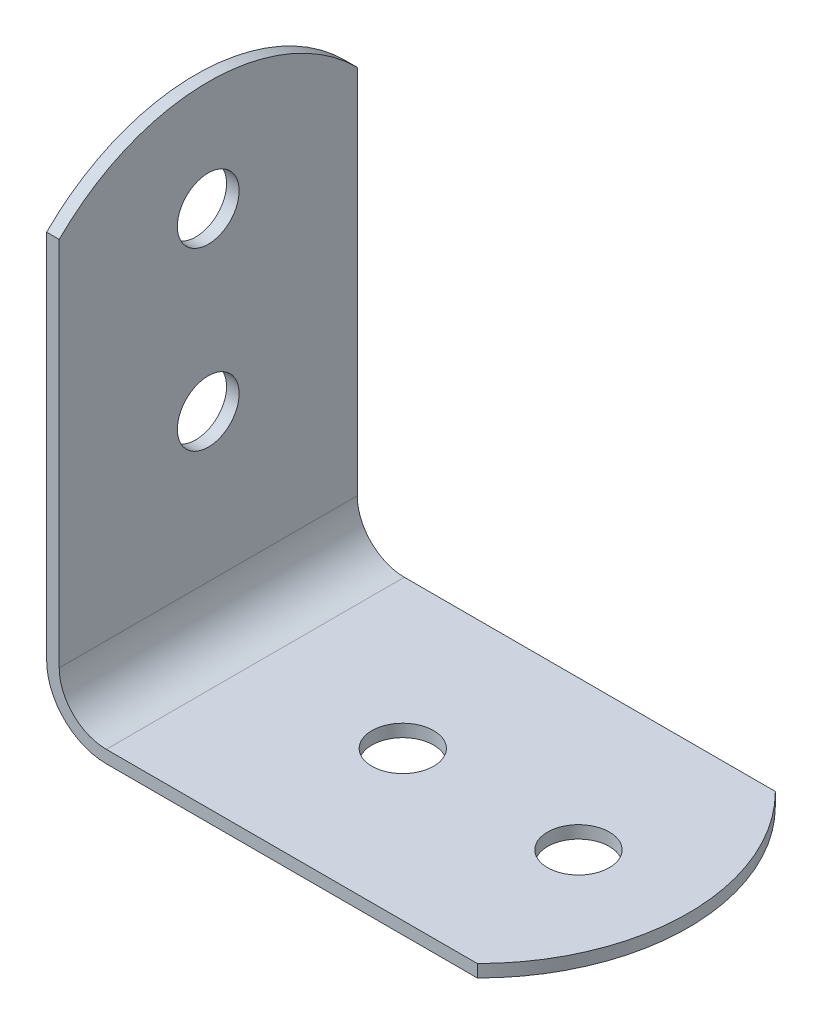
ISO-10303-21;
HEADER;
FILE_DESCRIPTION(('STEP AP214'),'2;1');
FILE_NAME('part.step','',(''),(''),'','','');
FILE_SCHEMA(('AUTOMOTIVE_DESIGN { 1 0 10303 214 1 1 1 1 }'));
ENDSEC;
DATA;
#1=APPLICATION_CONTEXT('core data for automotive mechanical design processes');
#2=APPLICATION_PROTOCOL_DEFINITION('international standard','automotive_design',2000,#1);
#3=PRODUCT_CONTEXT('',#1,'mechanical');
#4=PRODUCT('Part','Part','',(#3));
#5=PRODUCT_RELATED_PRODUCT_CATEGORY('part','',(#4));
#6=PRODUCT_DEFINITION_FORMATION('','',#4);
#7=PRODUCT_DEFINITION_CONTEXT('part definition',#1,'design');
#8=PRODUCT_DEFINITION('design','',#6,#7);
#9=PRODUCT_DEFINITION_SHAPE('','',#8);
#10=(LENGTH_UNIT() NAMED_UNIT(*) SI_UNIT(.MILLI.,.METRE.));
#11=(NAMED_UNIT(*) PLANE_ANGLE_UNIT() SI_UNIT($,.RADIAN.));
#12=(NAMED_UNIT(*) SI_UNIT($,.STERADIAN.) SOLID_ANGLE_UNIT());
#13=UNCERTAINTY_MEASURE_WITH_UNIT(LENGTH_MEASURE(1.E-05),#10,'distance_accuracy_value','');
#14=(GEOMETRIC_REPRESENTATION_CONTEXT(3) GLOBAL_UNCERTAINTY_ASSIGNED_CONTEXT((#13)) GLOBAL_UNIT_ASSIGNED_CONTEXT((#10,
#11,#12)) REPRESENTATION_CONTEXT('',''));
#15=CARTESIAN_POINT('',(0.,0.,0.));
#16=DIRECTION('',(0.,0.,1.));
#17=DIRECTION('',(1.,0.,0.));
#18=AXIS2_PLACEMENT_3D('',#15,#16,#17);
#19=CARTESIAN_POINT('',(0.,39.878,24.13));
#20=DIRECTION('',(1.,0.,0.));
#21=DIRECTION('',(0.,0.,-1.));
#22=AXIS2_PLACEMENT_3D('',#19,#20,#21);
#23=PLANE('',#22);
#24=CARTESIAN_POINT('',(0.,30.988,12.065));
#25=DIRECTION('',(-1.,0.,0.));
#26=DIRECTION('',(0.,0.,1.));
#27=AXIS2_PLACEMENT_3D('',#24,#25,#26);
#28=CIRCLE('',#27,2.5);
#29=CARTESIAN_POINT('',(0.,30.988,14.565));
#30=VERTEX_POINT('',#29);
#31=EDGE_CURVE('E201',#30,#30,#28,.T.);
#32=ORIENTED_EDGE('',*,*,#31,.F.);
#33=EDGE_LOOP('',(#32));
#34=FACE_BOUND('',#33,.T.);
#35=CARTESIAN_POINT('',(0.,16.764,12.065));
#36=DIRECTION('',(-1.,0.,0.));
#37=DIRECTION('',(0.,0.,1.));
#38=AXIS2_PLACEMENT_3D('',#35,#36,#37);
#39=CIRCLE('',#38,2.5);
#40=CARTESIAN_POINT('',(0.,16.764,14.565));
#41=VERTEX_POINT('',#40);
#42=EDGE_CURVE('E128',#41,#41,#39,.T.);
#43=ORIENTED_EDGE('',*,*,#42,.F.);
#44=EDGE_LOOP('',(#43));
#45=FACE_BOUND('',#44,.T.);
#46=DIRECTION('',(0.,-1.,0.));
#47=VECTOR('',#46,1.);
#48=CARTESIAN_POINT('',(0.,39.878,24.13));
#49=LINE('',#48,#47);
#50=CARTESIAN_POINT('',(0.,34.8620039576731,24.13));
#51=VERTEX_POINT('',#50);
#52=CARTESIAN_POINT('',(0.,4.826,24.13));
#53=VERTEX_POINT('',#52);
#54=EDGE_CURVE('E110',#51,#53,#49,.T.);
#55=ORIENTED_EDGE('',*,*,#54,.F.);
#56=CARTESIAN_POINT('',(0.,22.86,12.065));
#57=DIRECTION('',(1.,0.,0.));
#58=DIRECTION('',(0.,0.,-1.));
#59=AXIS2_PLACEMENT_3D('',#56,#57,#58);
#60=CIRCLE('',#59,17.018);
#61=CARTESIAN_POINT('',(0.,34.8620039576731,0.));
#62=VERTEX_POINT('',#61);
#63=EDGE_CURVE('E99',#62,#51,#60,.T.);
#64=ORIENTED_EDGE('',*,*,#63,.F.);
#65=DIRECTION('',(0.,-1.,0.));
#66=VECTOR('',#65,1.);
#67=CARTESIAN_POINT('',(0.,39.878,0.));
#68=LINE('',#67,#66);
#69=CARTESIAN_POINT('',(0.,4.826,0.));
#70=VERTEX_POINT('',#69);
#71=EDGE_CURVE('E134',#62,#70,#68,.T.);
#72=ORIENTED_EDGE('',*,*,#71,.T.);
#73=DIRECTION('',(0.,0.,-1.));
#74=VECTOR('',#73,1.);
#75=CARTESIAN_POINT('',(0.,4.826,24.13));
#76=LINE('',#75,#74);
#77=EDGE_CURVE('E116',#70,#53,#76,.F.);
#78=ORIENTED_EDGE('',*,*,#77,.T.);
#79=EDGE_LOOP('',(#55,#64,#72,#78));
#80=FACE_BOUND('',#79,.T.);
#81=ADVANCED_FACE('F37',(#34,#45,#80),#23,.F.);
#82=CARTESIAN_POINT('',(0.,0.,24.13));
#83=DIRECTION('',(0.,1.,0.));
#84=DIRECTION('',(0.,0.,1.));
#85=AXIS2_PLACEMENT_3D('',#82,#83,#84);
#86=PLANE('',#85);
#87=CARTESIAN_POINT('',(30.988,0.,12.065));
#88=DIRECTION('',(0.,-1.,0.));
#89=DIRECTION('',(0.,0.,-1.));
#90=AXIS2_PLACEMENT_3D('',#87,#88,#89);
#91=CIRCLE('',#90,2.49999999999999);
#92=CARTESIAN_POINT('',(30.988,0.,9.56500000000001));
#93=VERTEX_POINT('',#92);
#94=EDGE_CURVE('E184',#93,#93,#91,.T.);
#95=ORIENTED_EDGE('',*,*,#94,.F.);
#96=EDGE_LOOP('',(#95));
#97=FACE_BOUND('',#96,.T.);
#98=CARTESIAN_POINT('',(16.764,0.,12.065));
#99=DIRECTION('',(0.,-1.,0.));
#100=DIRECTION('',(0.,0.,-1.));
#101=AXIS2_PLACEMENT_3D('',#98,#99,#100);
#102=CIRCLE('',#101,2.49999999999999);
#103=CARTESIAN_POINT('',(16.764,0.,9.56500000000001));
#104=VERTEX_POINT('',#103);
#105=EDGE_CURVE('E195',#104,#104,#102,.T.);
#106=ORIENTED_EDGE('',*,*,#105,.F.);
#107=EDGE_LOOP('',(#106));
#108=FACE_BOUND('',#107,.T.);
#109=DIRECTION('',(1.,0.,0.));
#110=VECTOR('',#109,1.);
#111=CARTESIAN_POINT('',(0.,0.,0.));
#112=LINE('',#111,#110);
#113=CARTESIAN_POINT('',(4.826,0.,0.));
#114=VERTEX_POINT('',#113);
#115=CARTESIAN_POINT('',(34.8620039576731,0.,0.));
#116=VERTEX_POINT('',#115);
#117=EDGE_CURVE('E136',#114,#116,#112,.T.);
#118=ORIENTED_EDGE('',*,*,#117,.T.);
#119=CARTESIAN_POINT('',(22.86,0.,12.065));
#120=DIRECTION('',(0.,1.,0.));
#121=DIRECTION('',(0.,0.,1.));
#122=AXIS2_PLACEMENT_3D('',#119,#120,#121);
#123=CIRCLE('',#122,17.018);
#124=CARTESIAN_POINT('',(34.8620039576731,0.,24.13));
#125=VERTEX_POINT('',#124);
#126=EDGE_CURVE('E59',#125,#116,#123,.T.);
#127=ORIENTED_EDGE('',*,*,#126,.F.);
#128=DIRECTION('',(1.,0.,0.));
#129=VECTOR('',#128,1.);
#130=CARTESIAN_POINT('',(0.,0.,24.13));
#131=LINE('',#130,#129);
#132=CARTESIAN_POINT('',(4.826,0.,24.13));
#133=VERTEX_POINT('',#132);
#134=EDGE_CURVE('E118',#133,#125,#131,.T.);
#135=ORIENTED_EDGE('',*,*,#134,.F.);
#136=DIRECTION('',(0.,0.,-1.));
#137=VECTOR('',#136,1.);
#138=CARTESIAN_POINT('',(4.826,0.,24.13));
#139=LINE('',#138,#137);
#140=EDGE_CURVE('E151',#133,#114,#139,.T.);
#141=ORIENTED_EDGE('',*,*,#140,.T.);
#142=EDGE_LOOP('',(#118,#127,#135,#141));
#143=FACE_BOUND('',#142,.T.);
#144=ADVANCED_FACE('F167',(#97,#108,#143),#86,.F.);
#145=CARTESIAN_POINT('',(39.878,1.016,24.13));
#146=DIRECTION('',(0.,-1.,0.));
#147=DIRECTION('',(1.,0.,0.));
#148=AXIS2_PLACEMENT_3D('',#145,#146,#147);
#149=PLANE('',#148);
#150=CARTESIAN_POINT('',(30.988,1.016,12.065));
#151=DIRECTION('',(0.,-1.,0.));
#152=DIRECTION('',(1.,0.,0.));
#153=AXIS2_PLACEMENT_3D('',#150,#151,#152);
#154=CIRCLE('',#153,2.49999999999999);
#155=CARTESIAN_POINT('',(33.488,1.016,12.065));
#156=VERTEX_POINT('',#155);
#157=EDGE_CURVE('E188',#156,#156,#154,.T.);
#158=ORIENTED_EDGE('',*,*,#157,.T.);
#159=EDGE_LOOP('',(#158));
#160=FACE_BOUND('',#159,.T.);
#161=CARTESIAN_POINT('',(16.764,1.016,12.065));
#162=DIRECTION('',(0.,-1.,0.));
#163=DIRECTION('',(1.,0.,0.));
#164=AXIS2_PLACEMENT_3D('',#161,#162,#163);
#165=CIRCLE('',#164,2.49999999999999);
#166=CARTESIAN_POINT('',(19.264,1.016,12.065));
#167=VERTEX_POINT('',#166);
#168=EDGE_CURVE('E198',#167,#167,#165,.T.);
#169=ORIENTED_EDGE('',*,*,#168,.T.);
#170=EDGE_LOOP('',(#169));
#171=FACE_BOUND('',#170,.T.);
#172=DIRECTION('',(-1.,0.,0.));
#173=VECTOR('',#172,1.);
#174=CARTESIAN_POINT('',(39.878,1.016,24.13));
#175=LINE('',#174,#173);
#176=CARTESIAN_POINT('',(34.8620039576731,1.016,24.13));
#177=VERTEX_POINT('',#176);
#178=CARTESIAN_POINT('',(4.826,1.016,24.13));
#179=VERTEX_POINT('',#178);
#180=EDGE_CURVE('E122',#177,#179,#175,.T.);
#181=ORIENTED_EDGE('',*,*,#180,.F.);
#182=CARTESIAN_POINT('',(22.86,1.016,12.065));
#183=DIRECTION('',(0.,-1.,0.));
#184=DIRECTION('',(1.,0.,0.));
#185=AXIS2_PLACEMENT_3D('',#182,#183,#184);
#186=CIRCLE('',#185,17.018);
#187=CARTESIAN_POINT('',(34.8620039576731,1.016,0.));
#188=VERTEX_POINT('',#187);
#189=EDGE_CURVE('E182',#177,#188,#186,.F.);
#190=ORIENTED_EDGE('',*,*,#189,.T.);
#191=DIRECTION('',(-1.,0.,0.));
#192=VECTOR('',#191,1.);
#193=CARTESIAN_POINT('',(39.878,1.016,0.));
#194=LINE('',#193,#192);
#195=CARTESIAN_POINT('',(4.826,1.016,0.));
#196=VERTEX_POINT('',#195);
#197=EDGE_CURVE('E125',#188,#196,#194,.T.);
#198=ORIENTED_EDGE('',*,*,#197,.T.);
#199=DIRECTION('',(0.,0.,-1.));
#200=VECTOR('',#199,1.);
#201=CARTESIAN_POINT('',(4.826,1.016,24.13));
#202=LINE('',#201,#200);
#203=EDGE_CURVE('E143',#196,#179,#202,.F.);
#204=ORIENTED_EDGE('',*,*,#203,.T.);
#205=EDGE_LOOP('',(#181,#190,#198,#204));
#206=FACE_BOUND('',#205,.T.);
#207=ADVANCED_FACE('F181',(#160,#171,#206),#149,.F.);
#208=CARTESIAN_POINT('',(1.016,1.01599999999999,24.13));
#209=DIRECTION('',(-1.,0.,0.));
#210=DIRECTION('',(0.,0.,1.));
#211=AXIS2_PLACEMENT_3D('',#208,#209,#210);
#212=PLANE('',#211);
#213=CARTESIAN_POINT('',(1.016,30.988,12.065));
#214=DIRECTION('',(-1.,0.,0.));
#215=DIRECTION('',(0.,0.,1.));
#216=AXIS2_PLACEMENT_3D('',#213,#214,#215);
#217=CIRCLE('',#216,2.49999999999999);
#218=CARTESIAN_POINT('',(1.016,30.988,14.565));
#219=VERTEX_POINT('',#218);
#220=EDGE_CURVE('E203',#219,#219,#217,.T.);
#221=ORIENTED_EDGE('',*,*,#220,.T.);
#222=EDGE_LOOP('',(#221));
#223=FACE_BOUND('',#222,.T.);
#224=CARTESIAN_POINT('',(1.016,16.764,12.065));
#225=DIRECTION('',(-1.,0.,0.));
#226=DIRECTION('',(0.,0.,1.));
#227=AXIS2_PLACEMENT_3D('',#224,#225,#226);
#228=CIRCLE('',#227,2.49999999999999);
#229=CARTESIAN_POINT('',(1.016,16.764,14.565));
#230=VERTEX_POINT('',#229);
#231=EDGE_CURVE('E137',#230,#230,#228,.T.);
#232=ORIENTED_EDGE('',*,*,#231,.T.);
#233=EDGE_LOOP('',(#232));
#234=FACE_BOUND('',#233,.T.);
#235=DIRECTION('',(0.,1.,0.));
#236=VECTOR('',#235,1.);
#237=CARTESIAN_POINT('',(1.016,1.01599999999999,0.));
#238=LINE('',#237,#236);
#239=CARTESIAN_POINT('',(1.016,4.82599999999999,0.));
#240=VERTEX_POINT('',#239);
#241=CARTESIAN_POINT('',(1.016,34.8620039576731,0.));
#242=VERTEX_POINT('',#241);
#243=EDGE_CURVE('E119',#240,#242,#238,.T.);
#244=ORIENTED_EDGE('',*,*,#243,.T.);
#245=CARTESIAN_POINT('',(1.01600000000001,22.86,12.065));
#246=DIRECTION('',(-1.,0.,0.));
#247=DIRECTION('',(0.,0.,1.));
#248=AXIS2_PLACEMENT_3D('',#245,#246,#247);
#249=CIRCLE('',#248,17.018);
#250=CARTESIAN_POINT('',(1.01600000000003,34.8620039576731,24.13));
#251=VERTEX_POINT('',#250);
#252=EDGE_CURVE('E52',#242,#251,#249,.F.);
#253=ORIENTED_EDGE('',*,*,#252,.T.);
#254=DIRECTION('',(0.,1.,0.));
#255=VECTOR('',#254,1.);
#256=CARTESIAN_POINT('',(1.016,1.01599999999999,24.13));
#257=LINE('',#256,#255);
#258=CARTESIAN_POINT('',(1.016,4.82599999999999,24.13));
#259=VERTEX_POINT('',#258);
#260=EDGE_CURVE('E113',#259,#251,#257,.T.);
#261=ORIENTED_EDGE('',*,*,#260,.F.);
#262=DIRECTION('',(0.,0.,-1.));
#263=VECTOR('',#262,1.);
#264=CARTESIAN_POINT('',(1.016,4.82599999999999,0.));
#265=LINE('',#264,#263);
#266=EDGE_CURVE('E133',#259,#240,#265,.T.);
#267=ORIENTED_EDGE('',*,*,#266,.T.);
#268=EDGE_LOOP('',(#244,#253,#261,#267));
#269=FACE_BOUND('',#268,.T.);
#270=ADVANCED_FACE('F173',(#223,#234,#269),#212,.F.);
#271=CARTESIAN_POINT('',(0.,0.,24.13));
#272=DIRECTION('',(0.,0.,1.));
#273=DIRECTION('',(1.,0.,0.));
#274=AXIS2_PLACEMENT_3D('',#271,#272,#273);
#275=PLANE('',#274);
#276=DIRECTION('',(-1.,0.,0.));
#277=VECTOR('',#276,1.);
#278=CARTESIAN_POINT('',(39.878,34.8620039576731,24.13));
#279=LINE('',#278,#277);
#280=EDGE_CURVE('E102',#251,#51,#279,.T.);
#281=ORIENTED_EDGE('',*,*,#280,.T.);
#282=ORIENTED_EDGE('',*,*,#54,.T.);
#283=CARTESIAN_POINT('',(4.826,4.826,24.13));
#284=DIRECTION('',(0.,0.,1.));
#285=DIRECTION('',(1.,0.,0.));
#286=AXIS2_PLACEMENT_3D('',#283,#284,#285);
#287=CIRCLE('',#286,4.826);
#288=EDGE_CURVE('E158',#53,#133,#287,.T.);
#289=ORIENTED_EDGE('',*,*,#288,.T.);
#290=ORIENTED_EDGE('',*,*,#134,.T.);
#291=DIRECTION('',(0.,-1.,0.));
#292=VECTOR('',#291,1.);
#293=CARTESIAN_POINT('',(34.8620039576731,39.878,24.13));
#294=LINE('',#293,#292);
#295=EDGE_CURVE('E185',#177,#125,#294,.T.);
#296=ORIENTED_EDGE('',*,*,#295,.F.);
#297=ORIENTED_EDGE('',*,*,#180,.T.);
#298=CARTESIAN_POINT('',(4.826,4.82599999999999,24.13));
#299=DIRECTION('',(0.,0.,1.));
#300=DIRECTION('',(1.,0.,0.));
#301=AXIS2_PLACEMENT_3D('',#298,#299,#300);
#302=CIRCLE('',#301,3.81);
#303=EDGE_CURVE('E149',#179,#259,#302,.F.);
#304=ORIENTED_EDGE('',*,*,#303,.T.);
#305=ORIENTED_EDGE('',*,*,#260,.T.);
#306=EDGE_LOOP('',(#281,#282,#289,#290,#296,#297,#304,#305));
#307=FACE_BOUND('',#306,.T.);
#308=ADVANCED_FACE('F109',(#307),#275,.T.);
#309=CARTESIAN_POINT('',(0.,0.,0.));
#310=DIRECTION('',(0.,0.,1.));
#311=DIRECTION('',(1.,0.,0.));
#312=AXIS2_PLACEMENT_3D('',#309,#310,#311);
#313=PLANE('',#312);
#314=ORIENTED_EDGE('',*,*,#71,.F.);
#315=DIRECTION('',(-1.,0.,0.));
#316=VECTOR('',#315,1.);
#317=CARTESIAN_POINT('',(39.878,34.8620039576731,0.));
#318=LINE('',#317,#316);
#319=EDGE_CURVE('E11',#62,#242,#318,.F.);
#320=ORIENTED_EDGE('',*,*,#319,.T.);
#321=ORIENTED_EDGE('',*,*,#243,.F.);
#322=CARTESIAN_POINT('',(4.826,4.82599999999999,0.));
#323=DIRECTION('',(0.,0.,1.));
#324=DIRECTION('',(1.,0.,0.));
#325=AXIS2_PLACEMENT_3D('',#322,#323,#324);
#326=CIRCLE('',#325,3.81);
#327=EDGE_CURVE('E146',#240,#196,#326,.T.);
#328=ORIENTED_EDGE('',*,*,#327,.T.);
#329=ORIENTED_EDGE('',*,*,#197,.F.);
#330=DIRECTION('',(0.,-1.,0.));
#331=VECTOR('',#330,1.);
#332=CARTESIAN_POINT('',(34.8620039576731,39.878,0.));
#333=LINE('',#332,#331);
#334=EDGE_CURVE('E45',#188,#116,#333,.T.);
#335=ORIENTED_EDGE('',*,*,#334,.T.);
#336=ORIENTED_EDGE('',*,*,#117,.F.);
#337=CARTESIAN_POINT('',(4.826,4.826,0.));
#338=DIRECTION('',(0.,0.,1.));
#339=DIRECTION('',(1.,0.,0.));
#340=AXIS2_PLACEMENT_3D('',#337,#338,#339);
#341=CIRCLE('',#340,4.826);
#342=EDGE_CURVE('E154',#114,#70,#341,.F.);
#343=ORIENTED_EDGE('',*,*,#342,.T.);
#344=EDGE_LOOP('',(#314,#320,#321,#328,#329,#335,#336,#343));
#345=FACE_BOUND('',#344,.T.);
#346=ADVANCED_FACE('F164',(#345),#313,.F.);
#347=CARTESIAN_POINT('',(4.826,4.82599999999999,24.13));
#348=DIRECTION('',(0.,0.,1.));
#349=DIRECTION('',(1.,0.,0.));
#350=AXIS2_PLACEMENT_3D('',#347,#348,#349);
#351=CYLINDRICAL_SURFACE('',#350,3.81);
#352=ORIENTED_EDGE('',*,*,#303,.F.);
#353=ORIENTED_EDGE('',*,*,#203,.F.);
#354=ORIENTED_EDGE('',*,*,#327,.F.);
#355=ORIENTED_EDGE('',*,*,#266,.F.);
#356=EDGE_LOOP('',(#352,#353,#354,#355));
#357=FACE_BOUND('',#356,.T.);
#358=ADVANCED_FACE('F177',(#357),#351,.F.);
#359=CARTESIAN_POINT('',(4.826,4.826,24.13));
#360=DIRECTION('',(0.,0.,-1.));
#361=DIRECTION('',(-1.,0.,0.));
#362=AXIS2_PLACEMENT_3D('',#359,#360,#361);
#363=CYLINDRICAL_SURFACE('',#362,4.826);
#364=ORIENTED_EDGE('',*,*,#288,.F.);
#365=ORIENTED_EDGE('',*,*,#77,.F.);
#366=ORIENTED_EDGE('',*,*,#342,.F.);
#367=ORIENTED_EDGE('',*,*,#140,.F.);
#368=EDGE_LOOP('',(#364,#365,#366,#367));
#369=FACE_BOUND('',#368,.T.);
#370=ADVANCED_FACE('F39',(#369),#363,.T.);
#371=CARTESIAN_POINT('',(0.,16.764,12.065));
#372=DIRECTION('',(-1.,0.,0.));
#373=DIRECTION('',(0.,0.,1.));
#374=AXIS2_PLACEMENT_3D('',#371,#372,#373);
#375=CYLINDRICAL_SURFACE('',#374,2.49999999999999);
#376=ORIENTED_EDGE('',*,*,#42,.T.);
#377=EDGE_LOOP('',(#376));
#378=FACE_BOUND('',#377,.T.);
#379=ORIENTED_EDGE('',*,*,#231,.F.);
#380=EDGE_LOOP('',(#379));
#381=FACE_BOUND('',#380,.T.);
#382=ADVANCED_FACE('F210',(#378,#381),#375,.F.);
#383=CARTESIAN_POINT('',(0.,30.988,12.065));
#384=DIRECTION('',(-1.,0.,0.));
#385=DIRECTION('',(0.,0.,1.));
#386=AXIS2_PLACEMENT_3D('',#383,#384,#385);
#387=CYLINDRICAL_SURFACE('',#386,2.49999999999999);
#388=ORIENTED_EDGE('',*,*,#31,.T.);
#389=EDGE_LOOP('',(#388));
#390=FACE_BOUND('',#389,.T.);
#391=ORIENTED_EDGE('',*,*,#220,.F.);
#392=EDGE_LOOP('',(#391));
#393=FACE_BOUND('',#392,.T.);
#394=ADVANCED_FACE('F247',(#390,#393),#387,.F.);
#395=CARTESIAN_POINT('',(16.764,0.,12.065));
#396=DIRECTION('',(0.,-1.,0.));
#397=DIRECTION('',(0.,0.,-1.));
#398=AXIS2_PLACEMENT_3D('',#395,#396,#397);
#399=CYLINDRICAL_SURFACE('',#398,2.49999999999999);
#400=ORIENTED_EDGE('',*,*,#105,.T.);
#401=EDGE_LOOP('',(#400));
#402=FACE_BOUND('',#401,.T.);
#403=ORIENTED_EDGE('',*,*,#168,.F.);
#404=EDGE_LOOP('',(#403));
#405=FACE_BOUND('',#404,.T.);
#406=ADVANCED_FACE('F244',(#402,#405),#399,.F.);
#407=CARTESIAN_POINT('',(30.988,0.,12.065));
#408=DIRECTION('',(0.,-1.,0.));
#409=DIRECTION('',(0.,0.,-1.));
#410=AXIS2_PLACEMENT_3D('',#407,#408,#409);
#411=CYLINDRICAL_SURFACE('',#410,2.49999999999999);
#412=ORIENTED_EDGE('',*,*,#94,.T.);
#413=EDGE_LOOP('',(#412));
#414=FACE_BOUND('',#413,.T.);
#415=ORIENTED_EDGE('',*,*,#157,.F.);
#416=EDGE_LOOP('',(#415));
#417=FACE_BOUND('',#416,.T.);
#418=ADVANCED_FACE('F246',(#414,#417),#411,.F.);
#419=CARTESIAN_POINT('',(22.86,39.878,12.065));
#420=DIRECTION('',(0.,-1.,0.));
#421=DIRECTION('',(0.,0.,-1.));
#422=AXIS2_PLACEMENT_3D('',#419,#420,#421);
#423=CYLINDRICAL_SURFACE('',#422,17.018);
#424=ORIENTED_EDGE('',*,*,#126,.T.);
#425=ORIENTED_EDGE('',*,*,#334,.F.);
#426=ORIENTED_EDGE('',*,*,#189,.F.);
#427=ORIENTED_EDGE('',*,*,#295,.T.);
#428=EDGE_LOOP('',(#424,#425,#426,#427));
#429=FACE_BOUND('',#428,.T.);
#430=ADVANCED_FACE('F254',(#429),#423,.T.);
#431=CARTESIAN_POINT('',(39.878,22.86,12.065));
#432=DIRECTION('',(-1.,0.,0.));
#433=DIRECTION('',(0.,0.,1.));
#434=AXIS2_PLACEMENT_3D('',#431,#432,#433);
#435=CYLINDRICAL_SURFACE('',#434,17.018);
#436=ORIENTED_EDGE('',*,*,#63,.T.);
#437=ORIENTED_EDGE('',*,*,#280,.F.);
#438=ORIENTED_EDGE('',*,*,#252,.F.);
#439=ORIENTED_EDGE('',*,*,#319,.F.);
#440=EDGE_LOOP('',(#436,#437,#438,#439));
#441=FACE_BOUND('',#440,.T.);
#442=ADVANCED_FACE('F101',(#441),#435,.T.);
#443=CLOSED_SHELL('',(#81,#144,#207,#270,#308,#346,#358,#370,#382,#394,#406,#418,#430,#442));
#444=MANIFOLD_SOLID_BREP('B2',#443);
#445=ADVANCED_BREP_SHAPE_REPRESENTATION('',(#18,#444),#14);
#446=SHAPE_DEFINITION_REPRESENTATION(#9,#445);
ENDSEC;
END-ISO-10303-21;
